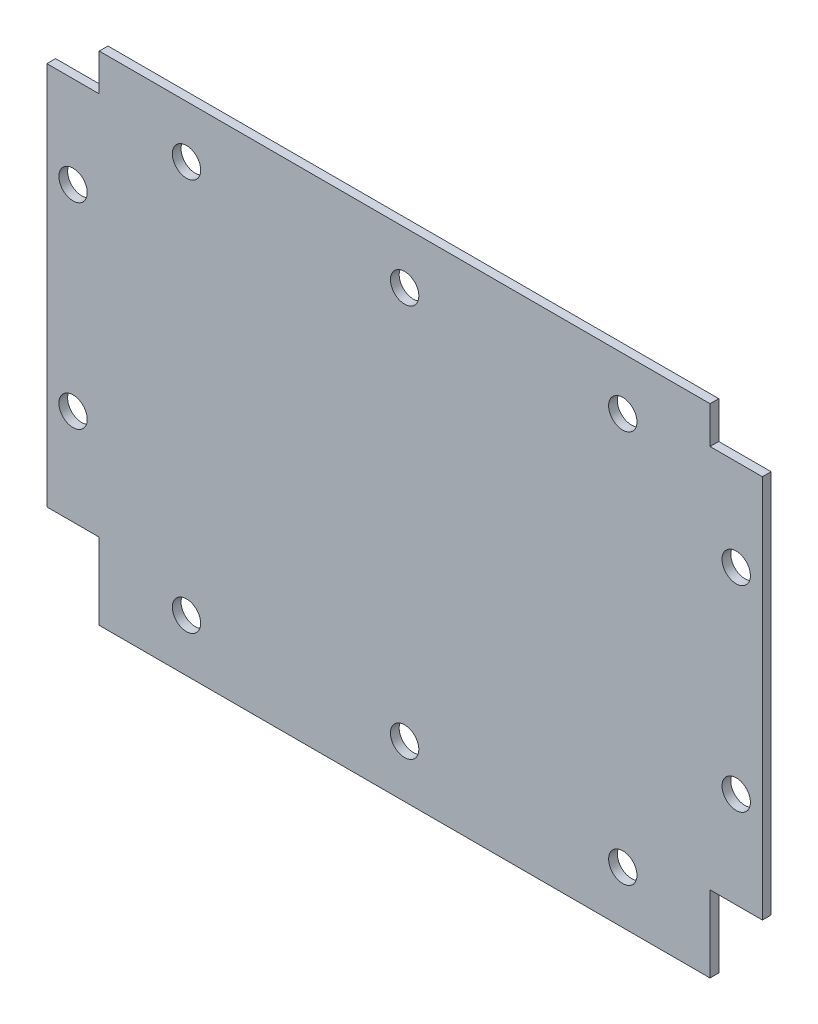
ISO-10303-21;
HEADER;
FILE_DESCRIPTION(('STEP AP214'),'2;1');
FILE_NAME('part.step','',(''),(''),'','','');
FILE_SCHEMA(('AUTOMOTIVE_DESIGN { 1 0 10303 214 1 1 1 1 }'));
ENDSEC;
DATA;
#1=APPLICATION_CONTEXT('core data for automotive mechanical design processes');
#2=APPLICATION_PROTOCOL_DEFINITION('international standard','automotive_design',2000,#1);
#3=PRODUCT_CONTEXT('',#1,'mechanical');
#4=PRODUCT('Part','Part','',(#3));
#5=PRODUCT_RELATED_PRODUCT_CATEGORY('part','',(#4));
#6=PRODUCT_DEFINITION_FORMATION('','',#4);
#7=PRODUCT_DEFINITION_CONTEXT('part definition',#1,'design');
#8=PRODUCT_DEFINITION('design','',#6,#7);
#9=PRODUCT_DEFINITION_SHAPE('','',#8);
#10=(LENGTH_UNIT() NAMED_UNIT(*) SI_UNIT(.MILLI.,.METRE.));
#11=(NAMED_UNIT(*) PLANE_ANGLE_UNIT() SI_UNIT($,.RADIAN.));
#12=(NAMED_UNIT(*) SI_UNIT($,.STERADIAN.) SOLID_ANGLE_UNIT());
#13=UNCERTAINTY_MEASURE_WITH_UNIT(LENGTH_MEASURE(1.E-05),#10,'distance_accuracy_value','');
#14=(GEOMETRIC_REPRESENTATION_CONTEXT(3) GLOBAL_UNCERTAINTY_ASSIGNED_CONTEXT((#13)) GLOBAL_UNIT_ASSIGNED_CONTEXT((#10,
#11,#12)) REPRESENTATION_CONTEXT('',''));
#15=CARTESIAN_POINT('',(0.,0.,0.));
#16=DIRECTION('',(0.,0.,1.));
#17=DIRECTION('',(1.,0.,0.));
#18=AXIS2_PLACEMENT_3D('',#15,#16,#17);
#19=CARTESIAN_POINT('',(70.,57.,2.));
#20=DIRECTION('',(0.,0.,-1.));
#21=DIRECTION('',(-1.,0.,0.));
#22=AXIS2_PLACEMENT_3D('',#19,#20,#21);
#23=PLANE('',#22);
#24=CARTESIAN_POINT('',(-76.,27.5,2.));
#25=DIRECTION('',(0.,0.,1.));
#26=DIRECTION('',(1.,0.,0.));
#27=AXIS2_PLACEMENT_3D('',#24,#25,#26);
#28=CIRCLE('',#27,3.24999999999999);
#29=CARTESIAN_POINT('',(-72.75,27.5,2.));
#30=VERTEX_POINT('',#29);
#31=EDGE_CURVE('E312',#30,#30,#28,.T.);
#32=ORIENTED_EDGE('',*,*,#31,.F.);
#33=EDGE_LOOP('',(#32));
#34=FACE_BOUND('',#33,.T.);
#35=CARTESIAN_POINT('',(-76.,-17.5,2.));
#36=DIRECTION('',(0.,0.,1.));
#37=DIRECTION('',(1.,0.,0.));
#38=AXIS2_PLACEMENT_3D('',#35,#36,#37);
#39=CIRCLE('',#38,3.24999999999999);
#40=CARTESIAN_POINT('',(-72.75,-17.5,2.));
#41=VERTEX_POINT('',#40);
#42=EDGE_CURVE('E318',#41,#41,#39,.T.);
#43=ORIENTED_EDGE('',*,*,#42,.F.);
#44=EDGE_LOOP('',(#43));
#45=FACE_BOUND('',#44,.T.);
#46=CARTESIAN_POINT('',(-50.,-45.,2.));
#47=DIRECTION('',(0.,0.,1.));
#48=DIRECTION('',(1.,0.,0.));
#49=AXIS2_PLACEMENT_3D('',#46,#47,#48);
#50=CIRCLE('',#49,3.24999999999999);
#51=CARTESIAN_POINT('',(-46.75,-45.,2.));
#52=VERTEX_POINT('',#51);
#53=EDGE_CURVE('E327',#52,#52,#50,.T.);
#54=ORIENTED_EDGE('',*,*,#53,.F.);
#55=EDGE_LOOP('',(#54));
#56=FACE_BOUND('',#55,.T.);
#57=CARTESIAN_POINT('',(0.,-45.,2.));
#58=DIRECTION('',(0.,0.,1.));
#59=DIRECTION('',(1.,0.,0.));
#60=AXIS2_PLACEMENT_3D('',#57,#58,#59);
#61=CIRCLE('',#60,3.24999999999999);
#62=CARTESIAN_POINT('',(3.24999999999999,-45.,2.));
#63=VERTEX_POINT('',#62);
#64=EDGE_CURVE('E334',#63,#63,#61,.T.);
#65=ORIENTED_EDGE('',*,*,#64,.F.);
#66=EDGE_LOOP('',(#65));
#67=FACE_BOUND('',#66,.T.);
#68=CARTESIAN_POINT('',(50.,-45.,2.));
#69=DIRECTION('',(0.,0.,1.));
#70=DIRECTION('',(1.,0.,0.));
#71=AXIS2_PLACEMENT_3D('',#68,#69,#70);
#72=CIRCLE('',#71,3.24999999999999);
#73=CARTESIAN_POINT('',(53.25,-45.,2.));
#74=VERTEX_POINT('',#73);
#75=EDGE_CURVE('E341',#74,#74,#72,.T.);
#76=ORIENTED_EDGE('',*,*,#75,.F.);
#77=EDGE_LOOP('',(#76));
#78=FACE_BOUND('',#77,.T.);
#79=CARTESIAN_POINT('',(50.,45.,2.));
#80=DIRECTION('',(0.,0.,1.));
#81=DIRECTION('',(1.,0.,0.));
#82=AXIS2_PLACEMENT_3D('',#79,#80,#81);
#83=CIRCLE('',#82,3.24999999999999);
#84=CARTESIAN_POINT('',(53.25,45.,2.));
#85=VERTEX_POINT('',#84);
#86=EDGE_CURVE('E348',#85,#85,#83,.T.);
#87=ORIENTED_EDGE('',*,*,#86,.F.);
#88=EDGE_LOOP('',(#87));
#89=FACE_BOUND('',#88,.T.);
#90=DIRECTION('',(0.,1.,0.));
#91=VECTOR('',#90,1.);
#92=CARTESIAN_POINT('',(70.,48.5,2.));
#93=LINE('',#92,#91);
#94=CARTESIAN_POINT('',(70.,48.5,2.));
#95=VERTEX_POINT('',#94);
#96=CARTESIAN_POINT('',(70.,57.,2.));
#97=VERTEX_POINT('',#96);
#98=EDGE_CURVE('E180',#95,#97,#93,.T.);
#99=ORIENTED_EDGE('',*,*,#98,.T.);
#100=DIRECTION('',(-1.,0.,0.));
#101=VECTOR('',#100,1.);
#102=CARTESIAN_POINT('',(-70.,57.,2.));
#103=LINE('',#102,#101);
#104=CARTESIAN_POINT('',(-70.,57.,2.));
#105=VERTEX_POINT('',#104);
#106=EDGE_CURVE('E108',#97,#105,#103,.T.);
#107=ORIENTED_EDGE('',*,*,#106,.T.);
#108=DIRECTION('',(0.,-1.,0.));
#109=VECTOR('',#108,1.);
#110=CARTESIAN_POINT('',(-70.,48.5,2.));
#111=LINE('',#110,#109);
#112=CARTESIAN_POINT('',(-70.,48.5,2.));
#113=VERTEX_POINT('',#112);
#114=EDGE_CURVE('E207',#105,#113,#111,.T.);
#115=ORIENTED_EDGE('',*,*,#114,.T.);
#116=DIRECTION('',(-1.,0.,0.));
#117=VECTOR('',#116,1.);
#118=CARTESIAN_POINT('',(-82.,48.5,2.));
#119=LINE('',#118,#117);
#120=CARTESIAN_POINT('',(-82.,48.5,2.));
#121=VERTEX_POINT('',#120);
#122=EDGE_CURVE('E226',#113,#121,#119,.T.);
#123=ORIENTED_EDGE('',*,*,#122,.T.);
#124=DIRECTION('',(0.,-1.,0.));
#125=VECTOR('',#124,1.);
#126=CARTESIAN_POINT('',(-82.,48.5,2.));
#127=LINE('',#126,#125);
#128=CARTESIAN_POINT('',(-82.,-39.5,2.));
#129=VERTEX_POINT('',#128);
#130=EDGE_CURVE('E223',#121,#129,#127,.T.);
#131=ORIENTED_EDGE('',*,*,#130,.T.);
#132=DIRECTION('',(1.,0.,0.));
#133=VECTOR('',#132,1.);
#134=CARTESIAN_POINT('',(-82.,-39.5,2.));
#135=LINE('',#134,#133);
#136=CARTESIAN_POINT('',(-70.,-39.5,2.));
#137=VERTEX_POINT('',#136);
#138=EDGE_CURVE('E225',#129,#137,#135,.T.);
#139=ORIENTED_EDGE('',*,*,#138,.T.);
#140=DIRECTION('',(0.,-1.,0.));
#141=VECTOR('',#140,1.);
#142=CARTESIAN_POINT('',(-70.,-57.,2.));
#143=LINE('',#142,#141);
#144=CARTESIAN_POINT('',(-70.,-57.,2.));
#145=VERTEX_POINT('',#144);
#146=EDGE_CURVE('E228',#137,#145,#143,.T.);
#147=ORIENTED_EDGE('',*,*,#146,.T.);
#148=DIRECTION('',(1.,0.,0.));
#149=VECTOR('',#148,1.);
#150=CARTESIAN_POINT('',(-70.,-57.,2.));
#151=LINE('',#150,#149);
#152=CARTESIAN_POINT('',(70.,-57.,2.));
#153=VERTEX_POINT('',#152);
#154=EDGE_CURVE('E234',#145,#153,#151,.T.);
#155=ORIENTED_EDGE('',*,*,#154,.T.);
#156=DIRECTION('',(0.,1.,0.));
#157=VECTOR('',#156,1.);
#158=CARTESIAN_POINT('',(70.,-57.,2.));
#159=LINE('',#158,#157);
#160=CARTESIAN_POINT('',(70.,-39.5,2.));
#161=VERTEX_POINT('',#160);
#162=EDGE_CURVE('E139',#153,#161,#159,.T.);
#163=ORIENTED_EDGE('',*,*,#162,.T.);
#164=DIRECTION('',(1.,0.,0.));
#165=VECTOR('',#164,1.);
#166=CARTESIAN_POINT('',(70.,-39.5,2.));
#167=LINE('',#166,#165);
#168=CARTESIAN_POINT('',(82.,-39.5,2.));
#169=VERTEX_POINT('',#168);
#170=EDGE_CURVE('E133',#161,#169,#167,.T.);
#171=ORIENTED_EDGE('',*,*,#170,.T.);
#172=DIRECTION('',(0.,1.,0.));
#173=VECTOR('',#172,1.);
#174=CARTESIAN_POINT('',(82.,48.5,2.));
#175=LINE('',#174,#173);
#176=CARTESIAN_POINT('',(82.,48.5,2.));
#177=VERTEX_POINT('',#176);
#178=EDGE_CURVE('E137',#169,#177,#175,.T.);
#179=ORIENTED_EDGE('',*,*,#178,.T.);
#180=DIRECTION('',(-1.,0.,0.));
#181=VECTOR('',#180,1.);
#182=CARTESIAN_POINT('',(70.,48.5,2.));
#183=LINE('',#182,#181);
#184=EDGE_CURVE('E53',#177,#95,#183,.T.);
#185=ORIENTED_EDGE('',*,*,#184,.T.);
#186=EDGE_LOOP('',(#99,#107,#115,#123,#131,#139,#147,#155,#163,#171,#179,#185));
#187=FACE_BOUND('',#186,.T.);
#188=CARTESIAN_POINT('',(76.,-17.5,2.));
#189=DIRECTION('',(0.,0.,1.));
#190=DIRECTION('',(1.,0.,0.));
#191=AXIS2_PLACEMENT_3D('',#188,#189,#190);
#192=CIRCLE('',#191,3.24999999999999);
#193=CARTESIAN_POINT('',(79.25,-17.5,2.));
#194=VERTEX_POINT('',#193);
#195=EDGE_CURVE('E376',#194,#194,#192,.T.);
#196=ORIENTED_EDGE('',*,*,#195,.F.);
#197=EDGE_LOOP('',(#196));
#198=FACE_BOUND('',#197,.T.);
#199=CARTESIAN_POINT('',(76.,27.5,2.));
#200=DIRECTION('',(0.,0.,1.));
#201=DIRECTION('',(1.,0.,0.));
#202=AXIS2_PLACEMENT_3D('',#199,#200,#201);
#203=CIRCLE('',#202,3.24999999999999);
#204=CARTESIAN_POINT('',(79.25,27.5,2.));
#205=VERTEX_POINT('',#204);
#206=EDGE_CURVE('E369',#205,#205,#203,.T.);
#207=ORIENTED_EDGE('',*,*,#206,.F.);
#208=EDGE_LOOP('',(#207));
#209=FACE_BOUND('',#208,.T.);
#210=CARTESIAN_POINT('',(-50.,45.,2.));
#211=DIRECTION('',(0.,0.,1.));
#212=DIRECTION('',(1.,0.,0.));
#213=AXIS2_PLACEMENT_3D('',#210,#211,#212);
#214=CIRCLE('',#213,3.24999999999999);
#215=CARTESIAN_POINT('',(-46.75,45.,2.));
#216=VERTEX_POINT('',#215);
#217=EDGE_CURVE('E362',#216,#216,#214,.T.);
#218=ORIENTED_EDGE('',*,*,#217,.F.);
#219=EDGE_LOOP('',(#218));
#220=FACE_BOUND('',#219,.T.);
#221=CARTESIAN_POINT('',(0.,45.,2.));
#222=DIRECTION('',(0.,0.,1.));
#223=DIRECTION('',(1.,0.,0.));
#224=AXIS2_PLACEMENT_3D('',#221,#222,#223);
#225=CIRCLE('',#224,3.24999999999999);
#226=CARTESIAN_POINT('',(3.24999999999999,45.,2.));
#227=VERTEX_POINT('',#226);
#228=EDGE_CURVE('E355',#227,#227,#225,.T.);
#229=ORIENTED_EDGE('',*,*,#228,.F.);
#230=EDGE_LOOP('',(#229));
#231=FACE_BOUND('',#230,.T.);
#232=ADVANCED_FACE('F36',(#34,#45,#56,#67,#78,#89,#187,#198,#209,#220,#231),#23,.F.);
#233=CARTESIAN_POINT('',(70.,57.,0.));
#234=DIRECTION('',(0.,0.,-1.));
#235=DIRECTION('',(-1.,0.,0.));
#236=AXIS2_PLACEMENT_3D('',#233,#234,#235);
#237=PLANE('',#236);
#238=CARTESIAN_POINT('',(-76.,27.5,0.));
#239=DIRECTION('',(0.,0.,1.));
#240=DIRECTION('',(1.,0.,0.));
#241=AXIS2_PLACEMENT_3D('',#238,#239,#240);
#242=CIRCLE('',#241,3.25);
#243=CARTESIAN_POINT('',(-72.75,27.5,0.));
#244=VERTEX_POINT('',#243);
#245=EDGE_CURVE('E310',#244,#244,#242,.T.);
#246=ORIENTED_EDGE('',*,*,#245,.T.);
#247=EDGE_LOOP('',(#246));
#248=FACE_BOUND('',#247,.T.);
#249=CARTESIAN_POINT('',(-76.,-17.5,0.));
#250=DIRECTION('',(0.,0.,1.));
#251=DIRECTION('',(1.,0.,0.));
#252=AXIS2_PLACEMENT_3D('',#249,#250,#251);
#253=CIRCLE('',#252,3.25);
#254=CARTESIAN_POINT('',(-72.75,-17.5,0.));
#255=VERTEX_POINT('',#254);
#256=EDGE_CURVE('E324',#255,#255,#253,.T.);
#257=ORIENTED_EDGE('',*,*,#256,.T.);
#258=EDGE_LOOP('',(#257));
#259=FACE_BOUND('',#258,.T.);
#260=CARTESIAN_POINT('',(-50.,-45.,0.));
#261=DIRECTION('',(0.,0.,1.));
#262=DIRECTION('',(1.,0.,0.));
#263=AXIS2_PLACEMENT_3D('',#260,#261,#262);
#264=CIRCLE('',#263,3.25);
#265=CARTESIAN_POINT('',(-46.75,-45.,0.));
#266=VERTEX_POINT('',#265);
#267=EDGE_CURVE('E331',#266,#266,#264,.T.);
#268=ORIENTED_EDGE('',*,*,#267,.T.);
#269=EDGE_LOOP('',(#268));
#270=FACE_BOUND('',#269,.T.);
#271=CARTESIAN_POINT('',(0.,-45.,0.));
#272=DIRECTION('',(0.,0.,1.));
#273=DIRECTION('',(1.,0.,0.));
#274=AXIS2_PLACEMENT_3D('',#271,#272,#273);
#275=CIRCLE('',#274,3.25);
#276=CARTESIAN_POINT('',(3.25,-45.,0.));
#277=VERTEX_POINT('',#276);
#278=EDGE_CURVE('E338',#277,#277,#275,.T.);
#279=ORIENTED_EDGE('',*,*,#278,.T.);
#280=EDGE_LOOP('',(#279));
#281=FACE_BOUND('',#280,.T.);
#282=CARTESIAN_POINT('',(50.,-45.,0.));
#283=DIRECTION('',(0.,0.,1.));
#284=DIRECTION('',(1.,0.,0.));
#285=AXIS2_PLACEMENT_3D('',#282,#283,#284);
#286=CIRCLE('',#285,3.25);
#287=CARTESIAN_POINT('',(53.25,-45.,0.));
#288=VERTEX_POINT('',#287);
#289=EDGE_CURVE('E345',#288,#288,#286,.T.);
#290=ORIENTED_EDGE('',*,*,#289,.T.);
#291=EDGE_LOOP('',(#290));
#292=FACE_BOUND('',#291,.T.);
#293=CARTESIAN_POINT('',(50.,45.,0.));
#294=DIRECTION('',(0.,0.,1.));
#295=DIRECTION('',(1.,0.,0.));
#296=AXIS2_PLACEMENT_3D('',#293,#294,#295);
#297=CIRCLE('',#296,3.25);
#298=CARTESIAN_POINT('',(53.25,45.,0.));
#299=VERTEX_POINT('',#298);
#300=EDGE_CURVE('E352',#299,#299,#297,.T.);
#301=ORIENTED_EDGE('',*,*,#300,.T.);
#302=EDGE_LOOP('',(#301));
#303=FACE_BOUND('',#302,.T.);
#304=CARTESIAN_POINT('',(0.,45.,0.));
#305=DIRECTION('',(0.,0.,1.));
#306=DIRECTION('',(1.,0.,0.));
#307=AXIS2_PLACEMENT_3D('',#304,#305,#306);
#308=CIRCLE('',#307,3.25);
#309=CARTESIAN_POINT('',(3.25,45.,0.));
#310=VERTEX_POINT('',#309);
#311=EDGE_CURVE('E359',#310,#310,#308,.T.);
#312=ORIENTED_EDGE('',*,*,#311,.T.);
#313=EDGE_LOOP('',(#312));
#314=FACE_BOUND('',#313,.T.);
#315=CARTESIAN_POINT('',(-50.,45.,0.));
#316=DIRECTION('',(0.,0.,1.));
#317=DIRECTION('',(1.,0.,0.));
#318=AXIS2_PLACEMENT_3D('',#315,#316,#317);
#319=CIRCLE('',#318,3.25);
#320=CARTESIAN_POINT('',(-46.75,45.,0.));
#321=VERTEX_POINT('',#320);
#322=EDGE_CURVE('E366',#321,#321,#319,.T.);
#323=ORIENTED_EDGE('',*,*,#322,.T.);
#324=EDGE_LOOP('',(#323));
#325=FACE_BOUND('',#324,.T.);
#326=CARTESIAN_POINT('',(76.,27.5,0.));
#327=DIRECTION('',(0.,0.,1.));
#328=DIRECTION('',(1.,0.,0.));
#329=AXIS2_PLACEMENT_3D('',#326,#327,#328);
#330=CIRCLE('',#329,3.25);
#331=CARTESIAN_POINT('',(79.25,27.5,0.));
#332=VERTEX_POINT('',#331);
#333=EDGE_CURVE('E373',#332,#332,#330,.T.);
#334=ORIENTED_EDGE('',*,*,#333,.T.);
#335=EDGE_LOOP('',(#334));
#336=FACE_BOUND('',#335,.T.);
#337=DIRECTION('',(0.,1.,0.));
#338=VECTOR('',#337,1.);
#339=CARTESIAN_POINT('',(70.,48.5,0.));
#340=LINE('',#339,#338);
#341=CARTESIAN_POINT('',(70.,48.5,0.));
#342=VERTEX_POINT('',#341);
#343=CARTESIAN_POINT('',(70.,57.,0.));
#344=VERTEX_POINT('',#343);
#345=EDGE_CURVE('E157',#342,#344,#340,.T.);
#346=ORIENTED_EDGE('',*,*,#345,.F.);
#347=DIRECTION('',(-1.,0.,0.));
#348=VECTOR('',#347,1.);
#349=CARTESIAN_POINT('',(70.,48.5,0.));
#350=LINE('',#349,#348);
#351=CARTESIAN_POINT('',(82.,48.5,0.));
#352=VERTEX_POINT('',#351);
#353=EDGE_CURVE('E100',#352,#342,#350,.T.);
#354=ORIENTED_EDGE('',*,*,#353,.F.);
#355=DIRECTION('',(0.,1.,0.));
#356=VECTOR('',#355,1.);
#357=CARTESIAN_POINT('',(82.,48.5,0.));
#358=LINE('',#357,#356);
#359=CARTESIAN_POINT('',(82.,-39.5,0.));
#360=VERTEX_POINT('',#359);
#361=EDGE_CURVE('E94',#360,#352,#358,.T.);
#362=ORIENTED_EDGE('',*,*,#361,.F.);
#363=DIRECTION('',(1.,0.,0.));
#364=VECTOR('',#363,1.);
#365=CARTESIAN_POINT('',(70.,-39.5,0.));
#366=LINE('',#365,#364);
#367=CARTESIAN_POINT('',(70.,-39.5,0.));
#368=VERTEX_POINT('',#367);
#369=EDGE_CURVE('E147',#368,#360,#366,.T.);
#370=ORIENTED_EDGE('',*,*,#369,.F.);
#371=DIRECTION('',(0.,1.,0.));
#372=VECTOR('',#371,1.);
#373=CARTESIAN_POINT('',(70.,-57.,0.));
#374=LINE('',#373,#372);
#375=CARTESIAN_POINT('',(70.,-57.,0.));
#376=VERTEX_POINT('',#375);
#377=EDGE_CURVE('E175',#376,#368,#374,.T.);
#378=ORIENTED_EDGE('',*,*,#377,.F.);
#379=DIRECTION('',(1.,0.,0.));
#380=VECTOR('',#379,1.);
#381=CARTESIAN_POINT('',(-70.,-57.,0.));
#382=LINE('',#381,#380);
#383=CARTESIAN_POINT('',(-70.,-57.,0.));
#384=VERTEX_POINT('',#383);
#385=EDGE_CURVE('E173',#384,#376,#382,.T.);
#386=ORIENTED_EDGE('',*,*,#385,.F.);
#387=DIRECTION('',(0.,-1.,0.));
#388=VECTOR('',#387,1.);
#389=CARTESIAN_POINT('',(-70.,-57.,0.));
#390=LINE('',#389,#388);
#391=CARTESIAN_POINT('',(-70.,-39.5,0.));
#392=VERTEX_POINT('',#391);
#393=EDGE_CURVE('E171',#392,#384,#390,.T.);
#394=ORIENTED_EDGE('',*,*,#393,.F.);
#395=DIRECTION('',(1.,0.,0.));
#396=VECTOR('',#395,1.);
#397=CARTESIAN_POINT('',(-82.,-39.5,0.));
#398=LINE('',#397,#396);
#399=CARTESIAN_POINT('',(-82.,-39.5,0.));
#400=VERTEX_POINT('',#399);
#401=EDGE_CURVE('E169',#400,#392,#398,.T.);
#402=ORIENTED_EDGE('',*,*,#401,.F.);
#403=DIRECTION('',(0.,-1.,0.));
#404=VECTOR('',#403,1.);
#405=CARTESIAN_POINT('',(-82.,48.5,0.));
#406=LINE('',#405,#404);
#407=CARTESIAN_POINT('',(-82.,48.5,0.));
#408=VERTEX_POINT('',#407);
#409=EDGE_CURVE('E167',#408,#400,#406,.T.);
#410=ORIENTED_EDGE('',*,*,#409,.F.);
#411=DIRECTION('',(-1.,0.,0.));
#412=VECTOR('',#411,1.);
#413=CARTESIAN_POINT('',(-82.,48.5,0.));
#414=LINE('',#413,#412);
#415=CARTESIAN_POINT('',(-70.,48.5,0.));
#416=VERTEX_POINT('',#415);
#417=EDGE_CURVE('E165',#416,#408,#414,.T.);
#418=ORIENTED_EDGE('',*,*,#417,.F.);
#419=DIRECTION('',(0.,-1.,0.));
#420=VECTOR('',#419,1.);
#421=CARTESIAN_POINT('',(-70.,48.5,0.));
#422=LINE('',#421,#420);
#423=CARTESIAN_POINT('',(-70.,57.,0.));
#424=VERTEX_POINT('',#423);
#425=EDGE_CURVE('E163',#424,#416,#422,.T.);
#426=ORIENTED_EDGE('',*,*,#425,.F.);
#427=DIRECTION('',(-1.,0.,0.));
#428=VECTOR('',#427,1.);
#429=CARTESIAN_POINT('',(-70.,57.,0.));
#430=LINE('',#429,#428);
#431=EDGE_CURVE('E160',#344,#424,#430,.T.);
#432=ORIENTED_EDGE('',*,*,#431,.F.);
#433=EDGE_LOOP('',(#346,#354,#362,#370,#378,#386,#394,#402,#410,#418,#426,#432));
#434=FACE_BOUND('',#433,.T.);
#435=CARTESIAN_POINT('',(76.,-17.5,0.));
#436=DIRECTION('',(0.,0.,1.));
#437=DIRECTION('',(1.,0.,0.));
#438=AXIS2_PLACEMENT_3D('',#435,#436,#437);
#439=CIRCLE('',#438,3.25);
#440=CARTESIAN_POINT('',(79.25,-17.5,0.));
#441=VERTEX_POINT('',#440);
#442=EDGE_CURVE('E161',#441,#441,#439,.T.);
#443=ORIENTED_EDGE('',*,*,#442,.T.);
#444=EDGE_LOOP('',(#443));
#445=FACE_BOUND('',#444,.T.);
#446=ADVANCED_FACE('F211',(#248,#259,#270,#281,#292,#303,#314,#325,#336,#434,#445),#237,.T.);
#447=CARTESIAN_POINT('',(70.,48.5,2.));
#448=DIRECTION('',(-1.,0.,0.));
#449=DIRECTION('',(0.,0.,1.));
#450=AXIS2_PLACEMENT_3D('',#447,#448,#449);
#451=PLANE('',#450);
#452=ORIENTED_EDGE('',*,*,#345,.T.);
#453=DIRECTION('',(0.,0.,-1.));
#454=VECTOR('',#453,1.);
#455=CARTESIAN_POINT('',(70.,57.,2.));
#456=LINE('',#455,#454);
#457=EDGE_CURVE('E11',#97,#344,#456,.T.);
#458=ORIENTED_EDGE('',*,*,#457,.F.);
#459=ORIENTED_EDGE('',*,*,#98,.F.);
#460=DIRECTION('',(0.,0.,-1.));
#461=VECTOR('',#460,1.);
#462=CARTESIAN_POINT('',(70.,48.5,2.));
#463=LINE('',#462,#461);
#464=EDGE_CURVE('E153',#95,#342,#463,.T.);
#465=ORIENTED_EDGE('',*,*,#464,.T.);
#466=EDGE_LOOP('',(#452,#458,#459,#465));
#467=FACE_BOUND('',#466,.T.);
#468=ADVANCED_FACE('F38',(#467),#451,.F.);
#469=CARTESIAN_POINT('',(-70.,57.,2.));
#470=DIRECTION('',(0.,-1.,0.));
#471=DIRECTION('',(0.,0.,-1.));
#472=AXIS2_PLACEMENT_3D('',#469,#470,#471);
#473=PLANE('',#472);
#474=ORIENTED_EDGE('',*,*,#431,.T.);
#475=DIRECTION('',(0.,0.,-1.));
#476=VECTOR('',#475,1.);
#477=CARTESIAN_POINT('',(-70.,57.,2.));
#478=LINE('',#477,#476);
#479=EDGE_CURVE('E45',#105,#424,#478,.T.);
#480=ORIENTED_EDGE('',*,*,#479,.F.);
#481=ORIENTED_EDGE('',*,*,#106,.F.);
#482=ORIENTED_EDGE('',*,*,#457,.T.);
#483=EDGE_LOOP('',(#474,#480,#481,#482));
#484=FACE_BOUND('',#483,.T.);
#485=ADVANCED_FACE('F476',(#484),#473,.F.);
#486=CARTESIAN_POINT('',(-70.,48.5,2.));
#487=DIRECTION('',(1.,0.,0.));
#488=DIRECTION('',(0.,0.,-1.));
#489=AXIS2_PLACEMENT_3D('',#486,#487,#488);
#490=PLANE('',#489);
#491=ORIENTED_EDGE('',*,*,#425,.T.);
#492=DIRECTION('',(0.,0.,-1.));
#493=VECTOR('',#492,1.);
#494=CARTESIAN_POINT('',(-70.,48.5,2.));
#495=LINE('',#494,#493);
#496=EDGE_CURVE('E199',#113,#416,#495,.T.);
#497=ORIENTED_EDGE('',*,*,#496,.F.);
#498=ORIENTED_EDGE('',*,*,#114,.F.);
#499=ORIENTED_EDGE('',*,*,#479,.T.);
#500=EDGE_LOOP('',(#491,#497,#498,#499));
#501=FACE_BOUND('',#500,.T.);
#502=ADVANCED_FACE('F205',(#501),#490,.F.);
#503=CARTESIAN_POINT('',(-82.,48.5,2.));
#504=DIRECTION('',(0.,-1.,0.));
#505=DIRECTION('',(0.,0.,-1.));
#506=AXIS2_PLACEMENT_3D('',#503,#504,#505);
#507=PLANE('',#506);
#508=ORIENTED_EDGE('',*,*,#417,.T.);
#509=DIRECTION('',(0.,0.,-1.));
#510=VECTOR('',#509,1.);
#511=CARTESIAN_POINT('',(-82.,48.5,2.));
#512=LINE('',#511,#510);
#513=EDGE_CURVE('E196',#121,#408,#512,.T.);
#514=ORIENTED_EDGE('',*,*,#513,.F.);
#515=ORIENTED_EDGE('',*,*,#122,.F.);
#516=ORIENTED_EDGE('',*,*,#496,.T.);
#517=EDGE_LOOP('',(#508,#514,#515,#516));
#518=FACE_BOUND('',#517,.T.);
#519=ADVANCED_FACE('F217',(#518),#507,.F.);
#520=CARTESIAN_POINT('',(-82.,48.5,2.));
#521=DIRECTION('',(1.,0.,0.));
#522=DIRECTION('',(0.,1.,0.));
#523=AXIS2_PLACEMENT_3D('',#520,#521,#522);
#524=PLANE('',#523);
#525=ORIENTED_EDGE('',*,*,#409,.T.);
#526=DIRECTION('',(0.,0.,-1.));
#527=VECTOR('',#526,1.);
#528=CARTESIAN_POINT('',(-82.,-39.5,2.));
#529=LINE('',#528,#527);
#530=EDGE_CURVE('E193',#129,#400,#529,.T.);
#531=ORIENTED_EDGE('',*,*,#530,.F.);
#532=ORIENTED_EDGE('',*,*,#130,.F.);
#533=ORIENTED_EDGE('',*,*,#513,.T.);
#534=EDGE_LOOP('',(#525,#531,#532,#533));
#535=FACE_BOUND('',#534,.T.);
#536=ADVANCED_FACE('F221',(#535),#524,.F.);
#537=CARTESIAN_POINT('',(-82.,-39.5,2.));
#538=DIRECTION('',(0.,1.,0.));
#539=DIRECTION('',(0.,0.,1.));
#540=AXIS2_PLACEMENT_3D('',#537,#538,#539);
#541=PLANE('',#540);
#542=ORIENTED_EDGE('',*,*,#401,.T.);
#543=DIRECTION('',(0.,0.,-1.));
#544=VECTOR('',#543,1.);
#545=CARTESIAN_POINT('',(-70.,-39.5,2.));
#546=LINE('',#545,#544);
#547=EDGE_CURVE('E190',#137,#392,#546,.T.);
#548=ORIENTED_EDGE('',*,*,#547,.F.);
#549=ORIENTED_EDGE('',*,*,#138,.F.);
#550=ORIENTED_EDGE('',*,*,#530,.T.);
#551=EDGE_LOOP('',(#542,#548,#549,#550));
#552=FACE_BOUND('',#551,.T.);
#553=ADVANCED_FACE('F499',(#552),#541,.F.);
#554=CARTESIAN_POINT('',(-70.,-57.,2.));
#555=DIRECTION('',(1.,0.,0.));
#556=DIRECTION('',(0.,0.,-1.));
#557=AXIS2_PLACEMENT_3D('',#554,#555,#556);
#558=PLANE('',#557);
#559=ORIENTED_EDGE('',*,*,#393,.T.);
#560=DIRECTION('',(0.,0.,-1.));
#561=VECTOR('',#560,1.);
#562=CARTESIAN_POINT('',(-70.,-57.,2.));
#563=LINE('',#562,#561);
#564=EDGE_CURVE('E187',#145,#384,#563,.T.);
#565=ORIENTED_EDGE('',*,*,#564,.F.);
#566=ORIENTED_EDGE('',*,*,#146,.F.);
#567=ORIENTED_EDGE('',*,*,#547,.T.);
#568=EDGE_LOOP('',(#559,#565,#566,#567));
#569=FACE_BOUND('',#568,.T.);
#570=ADVANCED_FACE('F506',(#569),#558,.F.);
#571=CARTESIAN_POINT('',(-70.,-57.,2.));
#572=DIRECTION('',(0.,1.,0.));
#573=DIRECTION('',(-1.,0.,0.));
#574=AXIS2_PLACEMENT_3D('',#571,#572,#573);
#575=PLANE('',#574);
#576=ORIENTED_EDGE('',*,*,#385,.T.);
#577=DIRECTION('',(0.,0.,-1.));
#578=VECTOR('',#577,1.);
#579=CARTESIAN_POINT('',(70.,-57.,2.));
#580=LINE('',#579,#578);
#581=EDGE_CURVE('E184',#153,#376,#580,.T.);
#582=ORIENTED_EDGE('',*,*,#581,.F.);
#583=ORIENTED_EDGE('',*,*,#154,.F.);
#584=ORIENTED_EDGE('',*,*,#564,.T.);
#585=EDGE_LOOP('',(#576,#582,#583,#584));
#586=FACE_BOUND('',#585,.T.);
#587=ADVANCED_FACE('F240',(#586),#575,.F.);
#588=CARTESIAN_POINT('',(70.,-57.,2.));
#589=DIRECTION('',(-1.,0.,0.));
#590=DIRECTION('',(0.,0.,1.));
#591=AXIS2_PLACEMENT_3D('',#588,#589,#590);
#592=PLANE('',#591);
#593=ORIENTED_EDGE('',*,*,#377,.T.);
#594=DIRECTION('',(0.,0.,-1.));
#595=VECTOR('',#594,1.);
#596=CARTESIAN_POINT('',(70.,-39.5,2.));
#597=LINE('',#596,#595);
#598=EDGE_CURVE('E148',#161,#368,#597,.T.);
#599=ORIENTED_EDGE('',*,*,#598,.F.);
#600=ORIENTED_EDGE('',*,*,#162,.F.);
#601=ORIENTED_EDGE('',*,*,#581,.T.);
#602=EDGE_LOOP('',(#593,#599,#600,#601));
#603=FACE_BOUND('',#602,.T.);
#604=ADVANCED_FACE('F244',(#603),#592,.F.);
#605=CARTESIAN_POINT('',(70.,-39.5,2.));
#606=DIRECTION('',(0.,1.,0.));
#607=DIRECTION('',(-1.,0.,0.));
#608=AXIS2_PLACEMENT_3D('',#605,#606,#607);
#609=PLANE('',#608);
#610=ORIENTED_EDGE('',*,*,#369,.T.);
#611=DIRECTION('',(0.,0.,-1.));
#612=VECTOR('',#611,1.);
#613=CARTESIAN_POINT('',(82.,-39.5,2.));
#614=LINE('',#613,#612);
#615=EDGE_CURVE('E144',#169,#360,#614,.T.);
#616=ORIENTED_EDGE('',*,*,#615,.F.);
#617=ORIENTED_EDGE('',*,*,#170,.F.);
#618=ORIENTED_EDGE('',*,*,#598,.T.);
#619=EDGE_LOOP('',(#610,#616,#617,#618));
#620=FACE_BOUND('',#619,.T.);
#621=ADVANCED_FACE('F145',(#620),#609,.F.);
#622=CARTESIAN_POINT('',(82.,48.5,2.));
#623=DIRECTION('',(-1.,0.,0.));
#624=DIRECTION('',(0.,-1.,0.));
#625=AXIS2_PLACEMENT_3D('',#622,#623,#624);
#626=PLANE('',#625);
#627=ORIENTED_EDGE('',*,*,#361,.T.);
#628=DIRECTION('',(0.,0.,-1.));
#629=VECTOR('',#628,1.);
#630=CARTESIAN_POINT('',(82.,48.5,2.));
#631=LINE('',#630,#629);
#632=EDGE_CURVE('E149',#177,#352,#631,.T.);
#633=ORIENTED_EDGE('',*,*,#632,.F.);
#634=ORIENTED_EDGE('',*,*,#178,.F.);
#635=ORIENTED_EDGE('',*,*,#615,.T.);
#636=EDGE_LOOP('',(#627,#633,#634,#635));
#637=FACE_BOUND('',#636,.T.);
#638=ADVANCED_FACE('F151',(#637),#626,.F.);
#639=CARTESIAN_POINT('',(70.,48.5,2.));
#640=DIRECTION('',(0.,-1.,0.));
#641=DIRECTION('',(1.,0.,0.));
#642=AXIS2_PLACEMENT_3D('',#639,#640,#641);
#643=PLANE('',#642);
#644=ORIENTED_EDGE('',*,*,#353,.T.);
#645=ORIENTED_EDGE('',*,*,#464,.F.);
#646=ORIENTED_EDGE('',*,*,#184,.F.);
#647=ORIENTED_EDGE('',*,*,#632,.T.);
#648=EDGE_LOOP('',(#644,#645,#646,#647));
#649=FACE_BOUND('',#648,.T.);
#650=ADVANCED_FACE('F248',(#649),#643,.F.);
#651=CARTESIAN_POINT('',(76.,-17.5,2.));
#652=DIRECTION('',(0.,0.,1.));
#653=DIRECTION('',(1.,0.,0.));
#654=AXIS2_PLACEMENT_3D('',#651,#652,#653);
#655=CYLINDRICAL_SURFACE('',#654,3.25);
#656=ORIENTED_EDGE('',*,*,#442,.F.);
#657=EDGE_LOOP('',(#656));
#658=FACE_BOUND('',#657,.T.);
#659=ORIENTED_EDGE('',*,*,#195,.T.);
#660=EDGE_LOOP('',(#659));
#661=FACE_BOUND('',#660,.T.);
#662=ADVANCED_FACE('F250',(#658,#661),#655,.F.);
#663=CARTESIAN_POINT('',(76.,27.5,2.));
#664=DIRECTION('',(0.,0.,1.));
#665=DIRECTION('',(1.,0.,0.));
#666=AXIS2_PLACEMENT_3D('',#663,#664,#665);
#667=CYLINDRICAL_SURFACE('',#666,3.25);
#668=ORIENTED_EDGE('',*,*,#333,.F.);
#669=EDGE_LOOP('',(#668));
#670=FACE_BOUND('',#669,.T.);
#671=ORIENTED_EDGE('',*,*,#206,.T.);
#672=EDGE_LOOP('',(#671));
#673=FACE_BOUND('',#672,.T.);
#674=ADVANCED_FACE('F256',(#670,#673),#667,.F.);
#675=CARTESIAN_POINT('',(-50.,45.,2.));
#676=DIRECTION('',(0.,0.,1.));
#677=DIRECTION('',(1.,0.,0.));
#678=AXIS2_PLACEMENT_3D('',#675,#676,#677);
#679=CYLINDRICAL_SURFACE('',#678,3.25);
#680=ORIENTED_EDGE('',*,*,#322,.F.);
#681=EDGE_LOOP('',(#680));
#682=FACE_BOUND('',#681,.T.);
#683=ORIENTED_EDGE('',*,*,#217,.T.);
#684=EDGE_LOOP('',(#683));
#685=FACE_BOUND('',#684,.T.);
#686=ADVANCED_FACE('F273',(#682,#685),#679,.F.);
#687=CARTESIAN_POINT('',(0.,45.,2.));
#688=DIRECTION('',(0.,0.,1.));
#689=DIRECTION('',(1.,0.,0.));
#690=AXIS2_PLACEMENT_3D('',#687,#688,#689);
#691=CYLINDRICAL_SURFACE('',#690,3.24999999999999);
#692=ORIENTED_EDGE('',*,*,#311,.F.);
#693=EDGE_LOOP('',(#692));
#694=FACE_BOUND('',#693,.T.);
#695=ORIENTED_EDGE('',*,*,#228,.T.);
#696=EDGE_LOOP('',(#695));
#697=FACE_BOUND('',#696,.T.);
#698=ADVANCED_FACE('F277',(#694,#697),#691,.F.);
#699=CARTESIAN_POINT('',(50.,45.,2.));
#700=DIRECTION('',(0.,0.,1.));
#701=DIRECTION('',(1.,0.,0.));
#702=AXIS2_PLACEMENT_3D('',#699,#700,#701);
#703=CYLINDRICAL_SURFACE('',#702,3.25);
#704=ORIENTED_EDGE('',*,*,#300,.F.);
#705=EDGE_LOOP('',(#704));
#706=FACE_BOUND('',#705,.T.);
#707=ORIENTED_EDGE('',*,*,#86,.T.);
#708=EDGE_LOOP('',(#707));
#709=FACE_BOUND('',#708,.T.);
#710=ADVANCED_FACE('F281',(#706,#709),#703,.F.);
#711=CARTESIAN_POINT('',(50.,-45.,2.));
#712=DIRECTION('',(0.,0.,1.));
#713=DIRECTION('',(1.,0.,0.));
#714=AXIS2_PLACEMENT_3D('',#711,#712,#713);
#715=CYLINDRICAL_SURFACE('',#714,3.25);
#716=ORIENTED_EDGE('',*,*,#289,.F.);
#717=EDGE_LOOP('',(#716));
#718=FACE_BOUND('',#717,.T.);
#719=ORIENTED_EDGE('',*,*,#75,.T.);
#720=EDGE_LOOP('',(#719));
#721=FACE_BOUND('',#720,.T.);
#722=ADVANCED_FACE('F285',(#718,#721),#715,.F.);
#723=CARTESIAN_POINT('',(0.,-45.,2.));
#724=DIRECTION('',(0.,0.,1.));
#725=DIRECTION('',(1.,0.,0.));
#726=AXIS2_PLACEMENT_3D('',#723,#724,#725);
#727=CYLINDRICAL_SURFACE('',#726,3.24999999999999);
#728=ORIENTED_EDGE('',*,*,#278,.F.);
#729=EDGE_LOOP('',(#728));
#730=FACE_BOUND('',#729,.T.);
#731=ORIENTED_EDGE('',*,*,#64,.T.);
#732=EDGE_LOOP('',(#731));
#733=FACE_BOUND('',#732,.T.);
#734=ADVANCED_FACE('F289',(#730,#733),#727,.F.);
#735=CARTESIAN_POINT('',(-50.,-45.,2.));
#736=DIRECTION('',(0.,0.,1.));
#737=DIRECTION('',(1.,0.,0.));
#738=AXIS2_PLACEMENT_3D('',#735,#736,#737);
#739=CYLINDRICAL_SURFACE('',#738,3.25);
#740=ORIENTED_EDGE('',*,*,#267,.F.);
#741=EDGE_LOOP('',(#740));
#742=FACE_BOUND('',#741,.T.);
#743=ORIENTED_EDGE('',*,*,#53,.T.);
#744=EDGE_LOOP('',(#743));
#745=FACE_BOUND('',#744,.T.);
#746=ADVANCED_FACE('F293',(#742,#745),#739,.F.);
#747=CARTESIAN_POINT('',(-76.,-17.5,2.));
#748=DIRECTION('',(0.,0.,1.));
#749=DIRECTION('',(1.,0.,0.));
#750=AXIS2_PLACEMENT_3D('',#747,#748,#749);
#751=CYLINDRICAL_SURFACE('',#750,3.25);
#752=ORIENTED_EDGE('',*,*,#256,.F.);
#753=EDGE_LOOP('',(#752));
#754=FACE_BOUND('',#753,.T.);
#755=ORIENTED_EDGE('',*,*,#42,.T.);
#756=EDGE_LOOP('',(#755));
#757=FACE_BOUND('',#756,.T.);
#758=ADVANCED_FACE('F297',(#754,#757),#751,.F.);
#759=CARTESIAN_POINT('',(-76.,27.5,2.));
#760=DIRECTION('',(0.,0.,1.));
#761=DIRECTION('',(1.,0.,0.));
#762=AXIS2_PLACEMENT_3D('',#759,#760,#761);
#763=CYLINDRICAL_SURFACE('',#762,3.25);
#764=ORIENTED_EDGE('',*,*,#245,.F.);
#765=EDGE_LOOP('',(#764));
#766=FACE_BOUND('',#765,.T.);
#767=ORIENTED_EDGE('',*,*,#31,.T.);
#768=EDGE_LOOP('',(#767));
#769=FACE_BOUND('',#768,.T.);
#770=ADVANCED_FACE('F301',(#766,#769),#763,.F.);
#771=CLOSED_SHELL('',(#232,#446,#468,#485,#502,#519,#536,#553,#570,#587,#604,#621,#638,#650,
#662,#674,#686,#698,#710,#722,#734,#746,#758,#770));
#772=MANIFOLD_SOLID_BREP('B2',#771);
#773=ADVANCED_BREP_SHAPE_REPRESENTATION('',(#18,#772),#14);
#774=SHAPE_DEFINITION_REPRESENTATION(#9,#773);
ENDSEC;
END-ISO-10303-21;
